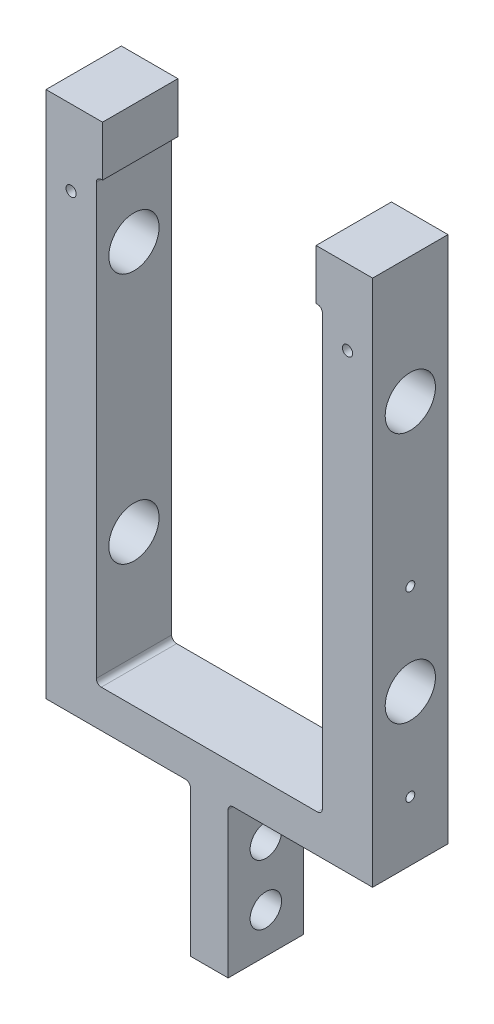
ISO-10303-21;
HEADER;
FILE_DESCRIPTION(('STEP AP214'),'2;1');
FILE_NAME('part.step','',(''),(''),'','','');
FILE_SCHEMA(('AUTOMOTIVE_DESIGN { 1 0 10303 214 1 1 1 1 }'));
ENDSEC;
DATA;
#1=APPLICATION_CONTEXT('core data for automotive mechanical design processes');
#2=APPLICATION_PROTOCOL_DEFINITION('international standard','automotive_design',2000,#1);
#3=PRODUCT_CONTEXT('',#1,'mechanical');
#4=PRODUCT('Part','Part','',(#3));
#5=PRODUCT_RELATED_PRODUCT_CATEGORY('part','',(#4));
#6=PRODUCT_DEFINITION_FORMATION('','',#4);
#7=PRODUCT_DEFINITION_CONTEXT('part definition',#1,'design');
#8=PRODUCT_DEFINITION('design','',#6,#7);
#9=PRODUCT_DEFINITION_SHAPE('','',#8);
#10=(LENGTH_UNIT() NAMED_UNIT(*) SI_UNIT(.MILLI.,.METRE.));
#11=(NAMED_UNIT(*) PLANE_ANGLE_UNIT() SI_UNIT($,.RADIAN.));
#12=(NAMED_UNIT(*) SI_UNIT($,.STERADIAN.) SOLID_ANGLE_UNIT());
#13=UNCERTAINTY_MEASURE_WITH_UNIT(LENGTH_MEASURE(1.E-05),#10,'distance_accuracy_value','');
#14=(GEOMETRIC_REPRESENTATION_CONTEXT(3) GLOBAL_UNCERTAINTY_ASSIGNED_CONTEXT((#13)) GLOBAL_UNIT_ASSIGNED_CONTEXT((#10,
#11,#12)) REPRESENTATION_CONTEXT('',''));
#15=CARTESIAN_POINT('',(0.,0.,0.));
#16=DIRECTION('',(0.,0.,1.));
#17=DIRECTION('',(1.,0.,0.));
#18=AXIS2_PLACEMENT_3D('',#15,#16,#17);
#19=CARTESIAN_POINT('',(41.275,152.4,9.52500000000001));
#20=DIRECTION('',(0.,-1.,0.));
#21=DIRECTION('',(0.,0.,-1.));
#22=AXIS2_PLACEMENT_3D('',#19,#20,#21);
#23=PLANE('',#22);
#24=DIRECTION('',(-1.,0.,0.));
#25=VECTOR('',#24,1.);
#26=CARTESIAN_POINT('',(41.275,152.4,-9.52500000000001));
#27=LINE('',#26,#25);
#28=CARTESIAN_POINT('',(41.275,152.4,-9.52500000000001));
#29=VERTEX_POINT('',#28);
#30=CARTESIAN_POINT('',(26.9875,152.4,-9.52500000000001));
#31=VERTEX_POINT('',#30);
#32=EDGE_CURVE('E275',#29,#31,#27,.T.);
#33=ORIENTED_EDGE('',*,*,#32,.T.);
#34=DIRECTION('',(0.,0.,1.));
#35=VECTOR('',#34,1.);
#36=CARTESIAN_POINT('',(26.9875,152.4,-9.52500000000001));
#37=LINE('',#36,#35);
#38=CARTESIAN_POINT('',(26.9875,152.4,9.52500000000001));
#39=VERTEX_POINT('',#38);
#40=EDGE_CURVE('E258',#31,#39,#37,.T.);
#41=ORIENTED_EDGE('',*,*,#40,.T.);
#42=DIRECTION('',(-1.,0.,0.));
#43=VECTOR('',#42,1.);
#44=CARTESIAN_POINT('',(41.275,152.4,9.52500000000001));
#45=LINE('',#44,#43);
#46=CARTESIAN_POINT('',(41.275,152.4,9.52500000000001));
#47=VERTEX_POINT('',#46);
#48=EDGE_CURVE('E467',#47,#39,#45,.T.);
#49=ORIENTED_EDGE('',*,*,#48,.F.);
#50=DIRECTION('',(0.,0.,-1.));
#51=VECTOR('',#50,1.);
#52=CARTESIAN_POINT('',(41.275,152.4,9.52500000000001));
#53=LINE('',#52,#51);
#54=EDGE_CURVE('E282',#47,#29,#53,.T.);
#55=ORIENTED_EDGE('',*,*,#54,.T.);
#56=EDGE_LOOP('',(#33,#41,#49,#55));
#57=FACE_BOUND('',#56,.T.);
#58=ADVANCED_FACE('F98',(#57),#23,.F.);
#59=CARTESIAN_POINT('',(28.575,139.7,9.52500000000001));
#60=DIRECTION('',(0.,-1.,0.));
#61=DIRECTION('',(0.,0.,-1.));
#62=AXIS2_PLACEMENT_3D('',#59,#60,#61);
#63=PLANE('',#62);
#64=DIRECTION('',(0.,0.,1.));
#65=VECTOR('',#64,1.);
#66=CARTESIAN_POINT('',(26.9875,139.7,-9.52500000000001));
#67=LINE('',#66,#65);
#68=CARTESIAN_POINT('',(26.9875,139.7,-9.52500000000001));
#69=VERTEX_POINT('',#68);
#70=CARTESIAN_POINT('',(26.9875,139.7,9.52500000000001));
#71=VERTEX_POINT('',#70);
#72=EDGE_CURVE('E515',#69,#71,#67,.T.);
#73=ORIENTED_EDGE('',*,*,#72,.F.);
#74=DIRECTION('',(-1.,0.,0.));
#75=VECTOR('',#74,1.);
#76=CARTESIAN_POINT('',(28.575,139.7,-9.52500000000001));
#77=LINE('',#76,#75);
#78=CARTESIAN_POINT('',(27.305,139.7,-9.52500000000001));
#79=VERTEX_POINT('',#78);
#80=EDGE_CURVE('E277',#79,#69,#77,.T.);
#81=ORIENTED_EDGE('',*,*,#80,.F.);
#82=DIRECTION('',(0.,0.,-1.));
#83=VECTOR('',#82,1.);
#84=CARTESIAN_POINT('',(27.305,139.7,9.52500000000001));
#85=LINE('',#84,#83);
#86=CARTESIAN_POINT('',(27.305,139.7,9.52500000000001));
#87=VERTEX_POINT('',#86);
#88=EDGE_CURVE('E374',#79,#87,#85,.F.);
#89=ORIENTED_EDGE('',*,*,#88,.T.);
#90=DIRECTION('',(-1.,0.,0.));
#91=VECTOR('',#90,1.);
#92=CARTESIAN_POINT('',(28.575,139.7,9.52500000000001));
#93=LINE('',#92,#91);
#94=EDGE_CURVE('E436',#87,#71,#93,.T.);
#95=ORIENTED_EDGE('',*,*,#94,.T.);
#96=EDGE_LOOP('',(#73,#81,#89,#95));
#97=FACE_BOUND('',#96,.T.);
#98=ADVANCED_FACE('F514',(#97),#63,.T.);
#99=CARTESIAN_POINT('',(41.275,131.596658993696,9.52500000000001));
#100=DIRECTION('',(-1.,0.,0.));
#101=DIRECTION('',(0.,-1.,0.));
#102=AXIS2_PLACEMENT_3D('',#99,#100,#101);
#103=PLANE('',#102);
#104=CARTESIAN_POINT('',(41.275,80.1624,0.));
#105=DIRECTION('',(1.,0.,0.));
#106=DIRECTION('',(0.,0.,-1.));
#107=AXIS2_PLACEMENT_3D('',#104,#105,#106);
#108=CIRCLE('',#107,1.13029999999999);
#109=CARTESIAN_POINT('',(41.275,80.1624,-1.1303));
#110=VERTEX_POINT('',#109);
#111=EDGE_CURVE('E702',#110,#110,#108,.T.);
#112=ORIENTED_EDGE('',*,*,#111,.F.);
#113=EDGE_LOOP('',(#112));
#114=FACE_BOUND('',#113,.T.);
#115=CARTESIAN_POINT('',(41.275,57.15,0.));
#116=DIRECTION('',(-1.,0.,0.));
#117=DIRECTION('',(0.,-1.,0.));
#118=AXIS2_PLACEMENT_3D('',#115,#116,#117);
#119=CIRCLE('',#118,6.34999999999673);
#120=CARTESIAN_POINT('',(41.275,50.8000000000033,0.));
#121=VERTEX_POINT('',#120);
#122=EDGE_CURVE('E324',#121,#121,#119,.T.);
#123=ORIENTED_EDGE('',*,*,#122,.T.);
#124=EDGE_LOOP('',(#123));
#125=FACE_BOUND('',#124,.T.);
#126=CARTESIAN_POINT('',(41.275,120.65,0.));
#127=DIRECTION('',(-1.,0.,0.));
#128=DIRECTION('',(0.,-1.,0.));
#129=AXIS2_PLACEMENT_3D('',#126,#127,#128);
#130=CIRCLE('',#129,6.34999999999999);
#131=CARTESIAN_POINT('',(41.275,114.3,0.));
#132=VERTEX_POINT('',#131);
#133=EDGE_CURVE('E628',#132,#132,#130,.T.);
#134=ORIENTED_EDGE('',*,*,#133,.T.);
#135=EDGE_LOOP('',(#134));
#136=FACE_BOUND('',#135,.T.);
#137=DIRECTION('',(0.,1.,0.));
#138=VECTOR('',#137,1.);
#139=CARTESIAN_POINT('',(41.275,131.596658993696,-9.52500000000001));
#140=LINE('',#139,#138);
#141=CARTESIAN_POINT('',(41.275,19.05,-9.52500000000001));
#142=VERTEX_POINT('',#141);
#143=EDGE_CURVE('E292',#142,#29,#140,.T.);
#144=ORIENTED_EDGE('',*,*,#143,.T.);
#145=ORIENTED_EDGE('',*,*,#54,.F.);
#146=DIRECTION('',(0.,1.,0.));
#147=VECTOR('',#146,1.);
#148=CARTESIAN_POINT('',(41.275,19.05,9.52500000000001));
#149=LINE('',#148,#147);
#150=CARTESIAN_POINT('',(41.275,19.05,9.52500000000001));
#151=VERTEX_POINT('',#150);
#152=EDGE_CURVE('E463',#151,#47,#149,.T.);
#153=ORIENTED_EDGE('',*,*,#152,.F.);
#154=DIRECTION('',(0.,0.,-1.));
#155=VECTOR('',#154,1.);
#156=CARTESIAN_POINT('',(41.275,19.05,9.52500000000001));
#157=LINE('',#156,#155);
#158=EDGE_CURVE('E314',#151,#142,#157,.T.);
#159=ORIENTED_EDGE('',*,*,#158,.T.);
#160=EDGE_LOOP('',(#144,#145,#153,#159));
#161=FACE_BOUND('',#160,.T.);
#162=CARTESIAN_POINT('',(41.275,34.1376,0.));
#163=DIRECTION('',(1.,0.,0.));
#164=DIRECTION('',(0.,0.,-1.));
#165=AXIS2_PLACEMENT_3D('',#162,#163,#164);
#166=CIRCLE('',#165,1.13029999999999);
#167=CARTESIAN_POINT('',(41.275,34.1376,-1.13029999999999));
#168=VERTEX_POINT('',#167);
#169=EDGE_CURVE('E690',#168,#168,#166,.T.);
#170=ORIENTED_EDGE('',*,*,#169,.F.);
#171=EDGE_LOOP('',(#170));
#172=FACE_BOUND('',#171,.T.);
#173=ADVANCED_FACE('F483',(#114,#125,#136,#161,#172),#103,.F.);
#174=CARTESIAN_POINT('',(28.575,139.7,9.52500000000001));
#175=DIRECTION('',(-1.,0.,0.));
#176=DIRECTION('',(0.,-1.,0.));
#177=AXIS2_PLACEMENT_3D('',#174,#175,#176);
#178=PLANE('',#177);
#179=CARTESIAN_POINT('',(28.575,80.1624,0.));
#180=DIRECTION('',(-1.,0.,0.));
#181=DIRECTION('',(0.,-1.,0.));
#182=AXIS2_PLACEMENT_3D('',#179,#180,#181);
#183=CIRCLE('',#182,1.13029999999999);
#184=CARTESIAN_POINT('',(28.575,79.0321,0.));
#185=VERTEX_POINT('',#184);
#186=EDGE_CURVE('E696',#185,#185,#183,.F.);
#187=ORIENTED_EDGE('',*,*,#186,.T.);
#188=EDGE_LOOP('',(#187));
#189=FACE_BOUND('',#188,.T.);
#190=DIRECTION('',(0.,1.,0.));
#191=VECTOR('',#190,1.);
#192=CARTESIAN_POINT('',(28.575,139.7,-9.52500000000001));
#193=LINE('',#192,#191);
#194=CARTESIAN_POINT('',(28.575,29.845,-9.52500000000001));
#195=VERTEX_POINT('',#194);
#196=CARTESIAN_POINT('',(28.575,138.43,-9.52500000000001));
#197=VERTEX_POINT('',#196);
#198=EDGE_CURVE('E457',#195,#197,#193,.T.);
#199=ORIENTED_EDGE('',*,*,#198,.F.);
#200=DIRECTION('',(0.,0.,-1.));
#201=VECTOR('',#200,1.);
#202=CARTESIAN_POINT('',(28.575,29.845,9.52500000000001));
#203=LINE('',#202,#201);
#204=CARTESIAN_POINT('',(28.575,29.845,9.52500000000001));
#205=VERTEX_POINT('',#204);
#206=EDGE_CURVE('E367',#195,#205,#203,.F.);
#207=ORIENTED_EDGE('',*,*,#206,.T.);
#208=DIRECTION('',(0.,1.,0.));
#209=VECTOR('',#208,1.);
#210=CARTESIAN_POINT('',(28.575,139.7,9.52500000000001));
#211=LINE('',#210,#209);
#212=CARTESIAN_POINT('',(28.575,138.43,9.52500000000001));
#213=VERTEX_POINT('',#212);
#214=EDGE_CURVE('E442',#205,#213,#211,.T.);
#215=ORIENTED_EDGE('',*,*,#214,.T.);
#216=DIRECTION('',(0.,0.,-1.));
#217=VECTOR('',#216,1.);
#218=CARTESIAN_POINT('',(28.575,138.43,-9.52500000000001));
#219=LINE('',#218,#217);
#220=EDGE_CURVE('E363',#213,#197,#219,.T.);
#221=ORIENTED_EDGE('',*,*,#220,.T.);
#222=EDGE_LOOP('',(#199,#207,#215,#221));
#223=FACE_BOUND('',#222,.T.);
#224=CARTESIAN_POINT('',(28.575,120.65,0.));
#225=DIRECTION('',(-1.,0.,0.));
#226=DIRECTION('',(0.,-1.,0.));
#227=AXIS2_PLACEMENT_3D('',#224,#225,#226);
#228=CIRCLE('',#227,6.34999999999999);
#229=CARTESIAN_POINT('',(28.575,114.3,0.));
#230=VERTEX_POINT('',#229);
#231=EDGE_CURVE('E319',#230,#230,#228,.T.);
#232=ORIENTED_EDGE('',*,*,#231,.F.);
#233=EDGE_LOOP('',(#232));
#234=FACE_BOUND('',#233,.T.);
#235=CARTESIAN_POINT('',(28.575,57.15,0.));
#236=DIRECTION('',(-1.,0.,0.));
#237=DIRECTION('',(0.,-1.,0.));
#238=AXIS2_PLACEMENT_3D('',#235,#236,#237);
#239=CIRCLE('',#238,6.34999999999673);
#240=CARTESIAN_POINT('',(28.575,50.8000000000033,0.));
#241=VERTEX_POINT('',#240);
#242=EDGE_CURVE('E325',#241,#241,#239,.T.);
#243=ORIENTED_EDGE('',*,*,#242,.F.);
#244=EDGE_LOOP('',(#243));
#245=FACE_BOUND('',#244,.T.);
#246=CARTESIAN_POINT('',(28.575,34.1376,0.));
#247=DIRECTION('',(-1.,0.,0.));
#248=DIRECTION('',(0.,-1.,0.));
#249=AXIS2_PLACEMENT_3D('',#246,#247,#248);
#250=CIRCLE('',#249,1.13029999999999);
#251=CARTESIAN_POINT('',(28.575,33.0073,0.));
#252=VERTEX_POINT('',#251);
#253=EDGE_CURVE('E501',#252,#252,#250,.F.);
#254=ORIENTED_EDGE('',*,*,#253,.T.);
#255=EDGE_LOOP('',(#254));
#256=FACE_BOUND('',#255,.T.);
#257=ADVANCED_FACE('F524',(#189,#223,#234,#245,#256),#178,.T.);
#258=CARTESIAN_POINT('',(0.,0.,9.52500000000001));
#259=DIRECTION('',(0.,0.,1.));
#260=DIRECTION('',(1.,0.,0.));
#261=AXIS2_PLACEMENT_3D('',#258,#259,#260);
#262=PLANE('',#261);
#263=CARTESIAN_POINT('',(-34.925,133.35,9.52500000000001));
#264=DIRECTION('',(0.,0.,1.));
#265=DIRECTION('',(1.,0.,0.));
#266=AXIS2_PLACEMENT_3D('',#263,#264,#265);
#267=CIRCLE('',#266,1.28904999999999);
#268=CARTESIAN_POINT('',(-33.63595,133.35,9.52500000000001));
#269=VERTEX_POINT('',#268);
#270=EDGE_CURVE('E823',#269,#269,#267,.T.);
#271=ORIENTED_EDGE('',*,*,#270,.F.);
#272=EDGE_LOOP('',(#271));
#273=FACE_BOUND('',#272,.T.);
#274=CARTESIAN_POINT('',(34.925,133.35,9.52500000000001));
#275=DIRECTION('',(0.,0.,1.));
#276=DIRECTION('',(1.,0.,0.));
#277=AXIS2_PLACEMENT_3D('',#274,#275,#276);
#278=CIRCLE('',#277,1.28904999999999);
#279=CARTESIAN_POINT('',(36.21405,133.35,9.52500000000001));
#280=VERTEX_POINT('',#279);
#281=EDGE_CURVE('E815',#280,#280,#278,.T.);
#282=ORIENTED_EDGE('',*,*,#281,.F.);
#283=EDGE_LOOP('',(#282));
#284=FACE_BOUND('',#283,.T.);
#285=DIRECTION('',(0.,1.,0.));
#286=VECTOR('',#285,1.);
#287=CARTESIAN_POINT('',(26.9875,152.4,9.52500000000001));
#288=LINE('',#287,#286);
#289=EDGE_CURVE('E261',#71,#39,#288,.T.);
#290=ORIENTED_EDGE('',*,*,#289,.F.);
#291=ORIENTED_EDGE('',*,*,#94,.F.);
#292=CARTESIAN_POINT('',(27.305,138.43,9.52500000000001));
#293=DIRECTION('',(0.,0.,1.));
#294=DIRECTION('',(1.,0.,0.));
#295=AXIS2_PLACEMENT_3D('',#292,#293,#294);
#296=CIRCLE('',#295,1.27);
#297=EDGE_CURVE('E404',#87,#213,#296,.F.);
#298=ORIENTED_EDGE('',*,*,#297,.T.);
#299=ORIENTED_EDGE('',*,*,#214,.F.);
#300=CARTESIAN_POINT('',(27.305,29.845,9.52500000000001));
#301=DIRECTION('',(0.,0.,1.));
#302=DIRECTION('',(1.,0.,0.));
#303=AXIS2_PLACEMENT_3D('',#300,#301,#302);
#304=CIRCLE('',#303,1.27);
#305=CARTESIAN_POINT('',(27.305,28.575,9.52500000000001));
#306=VERTEX_POINT('',#305);
#307=EDGE_CURVE('E398',#205,#306,#304,.F.);
#308=ORIENTED_EDGE('',*,*,#307,.T.);
#309=DIRECTION('',(1.,0.,0.));
#310=VECTOR('',#309,1.);
#311=CARTESIAN_POINT('',(-28.575,28.575,9.52500000000001));
#312=LINE('',#311,#310);
#313=CARTESIAN_POINT('',(-27.305,28.575,9.52500000000001));
#314=VERTEX_POINT('',#313);
#315=EDGE_CURVE('E435',#314,#306,#312,.T.);
#316=ORIENTED_EDGE('',*,*,#315,.F.);
#317=CARTESIAN_POINT('',(-27.305,29.845,9.52500000000001));
#318=DIRECTION('',(0.,0.,1.));
#319=DIRECTION('',(1.,0.,0.));
#320=AXIS2_PLACEMENT_3D('',#317,#318,#319);
#321=CIRCLE('',#320,1.27);
#322=CARTESIAN_POINT('',(-28.575,29.845,9.52500000000001));
#323=VERTEX_POINT('',#322);
#324=EDGE_CURVE('E392',#314,#323,#321,.F.);
#325=ORIENTED_EDGE('',*,*,#324,.T.);
#326=DIRECTION('',(0.,-1.,0.));
#327=VECTOR('',#326,1.);
#328=CARTESIAN_POINT('',(-28.575,139.7,9.52500000000001));
#329=LINE('',#328,#327);
#330=CARTESIAN_POINT('',(-28.575,138.43,9.52500000000001));
#331=VERTEX_POINT('',#330);
#332=EDGE_CURVE('E431',#331,#323,#329,.T.);
#333=ORIENTED_EDGE('',*,*,#332,.F.);
#334=CARTESIAN_POINT('',(-27.305,138.43,9.52500000000001));
#335=DIRECTION('',(0.,0.,1.));
#336=DIRECTION('',(1.,0.,0.));
#337=AXIS2_PLACEMENT_3D('',#334,#335,#336);
#338=CIRCLE('',#337,1.27);
#339=CARTESIAN_POINT('',(-27.305,139.7,9.52500000000001));
#340=VERTEX_POINT('',#339);
#341=EDGE_CURVE('E12',#331,#340,#338,.F.);
#342=ORIENTED_EDGE('',*,*,#341,.T.);
#343=CARTESIAN_POINT('',(-26.9875,139.7,9.52500000000001));
#344=VERTEX_POINT('',#343);
#345=EDGE_CURVE('E430',#344,#340,#93,.T.);
#346=ORIENTED_EDGE('',*,*,#345,.F.);
#347=DIRECTION('',(0.,-1.,0.));
#348=VECTOR('',#347,1.);
#349=CARTESIAN_POINT('',(-26.9875,152.4,9.52500000000001));
#350=LINE('',#349,#348);
#351=CARTESIAN_POINT('',(-26.9875,152.4,9.52500000000001));
#352=VERTEX_POINT('',#351);
#353=EDGE_CURVE('E114',#352,#344,#350,.T.);
#354=ORIENTED_EDGE('',*,*,#353,.F.);
#355=CARTESIAN_POINT('',(-41.275,152.4,9.52500000000001));
#356=VERTEX_POINT('',#355);
#357=EDGE_CURVE('E466',#352,#356,#45,.T.);
#358=ORIENTED_EDGE('',*,*,#357,.T.);
#359=DIRECTION('',(0.,-1.,0.));
#360=VECTOR('',#359,1.);
#361=CARTESIAN_POINT('',(-41.275,152.4,9.52500000000001));
#362=LINE('',#361,#360);
#363=CARTESIAN_POINT('',(-41.275,19.05,9.52500000000001));
#364=VERTEX_POINT('',#363);
#365=EDGE_CURVE('E470',#356,#364,#362,.T.);
#366=ORIENTED_EDGE('',*,*,#365,.T.);
#367=DIRECTION('',(1.,0.,0.));
#368=VECTOR('',#367,1.);
#369=CARTESIAN_POINT('',(-9.525,19.05,9.52500000000001));
#370=LINE('',#369,#368);
#371=CARTESIAN_POINT('',(-9.525,19.05,9.52500000000001));
#372=VERTEX_POINT('',#371);
#373=EDGE_CURVE('E304',#364,#372,#370,.T.);
#374=ORIENTED_EDGE('',*,*,#373,.T.);
#375=DIRECTION('',(0.,1.,0.));
#376=VECTOR('',#375,1.);
#377=CARTESIAN_POINT('',(-9.525,19.0579297952041,9.52500000000001));
#378=LINE('',#377,#376);
#379=CARTESIAN_POINT('',(-9.525,19.0579297952041,9.52500000000001));
#380=VERTEX_POINT('',#379);
#381=EDGE_CURVE('E657',#372,#380,#378,.T.);
#382=ORIENTED_EDGE('',*,*,#381,.T.);
#383=DIRECTION('',(1.,0.,0.));
#384=VECTOR('',#383,1.);
#385=CARTESIAN_POINT('',(-4.7625,19.0579297952041,9.52500000000001));
#386=LINE('',#385,#384);
#387=CARTESIAN_POINT('',(-6.0325,19.0579297952041,9.52500000000001));
#388=VERTEX_POINT('',#387);
#389=EDGE_CURVE('E651',#380,#388,#386,.T.);
#390=ORIENTED_EDGE('',*,*,#389,.T.);
#391=CARTESIAN_POINT('',(-6.0325,17.7879297952041,9.52500000000001));
#392=DIRECTION('',(0.,0.,1.));
#393=DIRECTION('',(1.,0.,0.));
#394=AXIS2_PLACEMENT_3D('',#391,#392,#393);
#395=CIRCLE('',#394,1.27);
#396=CARTESIAN_POINT('',(-4.7625,17.7879297952041,9.52500000000001));
#397=VERTEX_POINT('',#396);
#398=EDGE_CURVE('E386',#388,#397,#395,.F.);
#399=ORIENTED_EDGE('',*,*,#398,.T.);
#400=DIRECTION('',(0.,-1.,0.));
#401=VECTOR('',#400,1.);
#402=CARTESIAN_POINT('',(-4.7625,19.0579297952041,9.52500000000001));
#403=LINE('',#402,#401);
#404=CARTESIAN_POINT('',(-4.7625,-19.05,9.52500000000001));
#405=VERTEX_POINT('',#404);
#406=EDGE_CURVE('E646',#397,#405,#403,.T.);
#407=ORIENTED_EDGE('',*,*,#406,.T.);
#408=DIRECTION('',(-1.,0.,0.));
#409=VECTOR('',#408,1.);
#410=CARTESIAN_POINT('',(4.7625,-19.05,9.52500000000001));
#411=LINE('',#410,#409);
#412=CARTESIAN_POINT('',(4.7625,-19.05,9.52500000000001));
#413=VERTEX_POINT('',#412);
#414=EDGE_CURVE('E719',#413,#405,#411,.T.);
#415=ORIENTED_EDGE('',*,*,#414,.F.);
#416=DIRECTION('',(0.,1.,0.));
#417=VECTOR('',#416,1.);
#418=CARTESIAN_POINT('',(4.7625,19.05,9.52500000000001));
#419=LINE('',#418,#417);
#420=CARTESIAN_POINT('',(4.7625,17.78,9.52500000000001));
#421=VERTEX_POINT('',#420);
#422=EDGE_CURVE('E500',#413,#421,#419,.T.);
#423=ORIENTED_EDGE('',*,*,#422,.T.);
#424=CARTESIAN_POINT('',(6.0325,17.78,9.52500000000001));
#425=DIRECTION('',(0.,0.,1.));
#426=DIRECTION('',(1.,0.,0.));
#427=AXIS2_PLACEMENT_3D('',#424,#425,#426);
#428=CIRCLE('',#427,1.27);
#429=CARTESIAN_POINT('',(6.0325,19.05,9.52500000000001));
#430=VERTEX_POINT('',#429);
#431=EDGE_CURVE('E380',#421,#430,#428,.F.);
#432=ORIENTED_EDGE('',*,*,#431,.T.);
#433=DIRECTION('',(1.,0.,0.));
#434=VECTOR('',#433,1.);
#435=CARTESIAN_POINT('',(9.525,19.05,9.52500000000001));
#436=LINE('',#435,#434);
#437=EDGE_CURVE('E299',#430,#151,#436,.T.);
#438=ORIENTED_EDGE('',*,*,#437,.T.);
#439=ORIENTED_EDGE('',*,*,#152,.T.);
#440=ORIENTED_EDGE('',*,*,#48,.T.);
#441=EDGE_LOOP('',(#290,#291,#298,#299,#308,#316,#325,#333,#342,#346,#354,#358,#366,#374,#382,
#390,#399,#407,#415,#423,#432,#438,#439,#440));
#442=FACE_BOUND('',#441,.T.);
#443=ADVANCED_FACE('F429',(#273,#284,#442),#262,.T.);
#444=CARTESIAN_POINT('',(0.,0.,-9.52500000000001));
#445=DIRECTION('',(0.,0.,1.));
#446=DIRECTION('',(1.,0.,0.));
#447=AXIS2_PLACEMENT_3D('',#444,#445,#446);
#448=PLANE('',#447);
#449=CARTESIAN_POINT('',(-34.925,133.35,-9.52499999999999));
#450=DIRECTION('',(0.,0.,1.));
#451=DIRECTION('',(1.,0.,0.));
#452=AXIS2_PLACEMENT_3D('',#449,#450,#451);
#453=CIRCLE('',#452,1.28904999999999);
#454=CARTESIAN_POINT('',(-33.63595,133.35,-9.52499999999999));
#455=VERTEX_POINT('',#454);
#456=EDGE_CURVE('E819',#455,#455,#453,.T.);
#457=ORIENTED_EDGE('',*,*,#456,.T.);
#458=EDGE_LOOP('',(#457));
#459=FACE_BOUND('',#458,.T.);
#460=CARTESIAN_POINT('',(34.925,133.35,-9.52499999999999));
#461=DIRECTION('',(0.,0.,1.));
#462=DIRECTION('',(1.,0.,0.));
#463=AXIS2_PLACEMENT_3D('',#460,#461,#462);
#464=CIRCLE('',#463,1.28904999999999);
#465=CARTESIAN_POINT('',(36.21405,133.35,-9.52499999999999));
#466=VERTEX_POINT('',#465);
#467=EDGE_CURVE('E511',#466,#466,#464,.T.);
#468=ORIENTED_EDGE('',*,*,#467,.T.);
#469=EDGE_LOOP('',(#468));
#470=FACE_BOUND('',#469,.T.);
#471=ORIENTED_EDGE('',*,*,#80,.T.);
#472=DIRECTION('',(0.,1.,0.));
#473=VECTOR('',#472,1.);
#474=CARTESIAN_POINT('',(26.9875,152.4,-9.52500000000001));
#475=LINE('',#474,#473);
#476=EDGE_CURVE('E122',#69,#31,#475,.T.);
#477=ORIENTED_EDGE('',*,*,#476,.T.);
#478=ORIENTED_EDGE('',*,*,#32,.F.);
#479=ORIENTED_EDGE('',*,*,#143,.F.);
#480=DIRECTION('',(1.,0.,0.));
#481=VECTOR('',#480,1.);
#482=CARTESIAN_POINT('',(9.525,19.05,-9.52500000000001));
#483=LINE('',#482,#481);
#484=CARTESIAN_POINT('',(6.0325,19.05,-9.52500000000001));
#485=VERTEX_POINT('',#484);
#486=EDGE_CURVE('E451',#485,#142,#483,.T.);
#487=ORIENTED_EDGE('',*,*,#486,.F.);
#488=CARTESIAN_POINT('',(6.0325,17.78,-9.52500000000001));
#489=DIRECTION('',(0.,0.,1.));
#490=DIRECTION('',(1.,0.,0.));
#491=AXIS2_PLACEMENT_3D('',#488,#489,#490);
#492=CIRCLE('',#491,1.27);
#493=CARTESIAN_POINT('',(4.7625,17.78,-9.52500000000001));
#494=VERTEX_POINT('',#493);
#495=EDGE_CURVE('E377',#485,#494,#492,.T.);
#496=ORIENTED_EDGE('',*,*,#495,.T.);
#497=DIRECTION('',(0.,1.,0.));
#498=VECTOR('',#497,1.);
#499=CARTESIAN_POINT('',(4.7625,19.05,-9.52500000000001));
#500=LINE('',#499,#498);
#501=CARTESIAN_POINT('',(4.7625,-19.05,-9.52500000000001));
#502=VERTEX_POINT('',#501);
#503=EDGE_CURVE('E488',#502,#494,#500,.T.);
#504=ORIENTED_EDGE('',*,*,#503,.F.);
#505=DIRECTION('',(1.,0.,0.));
#506=VECTOR('',#505,1.);
#507=CARTESIAN_POINT('',(4.7625,-19.05,-9.52500000000001));
#508=LINE('',#507,#506);
#509=CARTESIAN_POINT('',(-4.7625,-19.05,-9.52500000000001));
#510=VERTEX_POINT('',#509);
#511=EDGE_CURVE('E708',#510,#502,#508,.T.);
#512=ORIENTED_EDGE('',*,*,#511,.F.);
#513=DIRECTION('',(0.,-1.,0.));
#514=VECTOR('',#513,1.);
#515=CARTESIAN_POINT('',(-4.7625,19.0579297952041,-9.52500000000001));
#516=LINE('',#515,#514);
#517=CARTESIAN_POINT('',(-4.7625,17.7879297952041,-9.52500000000001));
#518=VERTEX_POINT('',#517);
#519=EDGE_CURVE('E663',#518,#510,#516,.T.);
#520=ORIENTED_EDGE('',*,*,#519,.F.);
#521=CARTESIAN_POINT('',(-6.0325,17.7879297952041,-9.52500000000001));
#522=DIRECTION('',(0.,0.,1.));
#523=DIRECTION('',(1.,0.,0.));
#524=AXIS2_PLACEMENT_3D('',#521,#522,#523);
#525=CIRCLE('',#524,1.27);
#526=CARTESIAN_POINT('',(-6.0325,19.0579297952041,-9.52500000000001));
#527=VERTEX_POINT('',#526);
#528=EDGE_CURVE('E383',#518,#527,#525,.T.);
#529=ORIENTED_EDGE('',*,*,#528,.T.);
#530=DIRECTION('',(1.,0.,0.));
#531=VECTOR('',#530,1.);
#532=CARTESIAN_POINT('',(-4.7625,19.0579297952041,-9.52500000000001));
#533=LINE('',#532,#531);
#534=CARTESIAN_POINT('',(-9.525,19.0579297952041,-9.52500000000001));
#535=VERTEX_POINT('',#534);
#536=EDGE_CURVE('E668',#535,#527,#533,.T.);
#537=ORIENTED_EDGE('',*,*,#536,.F.);
#538=DIRECTION('',(0.,1.,0.));
#539=VECTOR('',#538,1.);
#540=CARTESIAN_POINT('',(-9.525,19.0579297952041,-9.52500000000001));
#541=LINE('',#540,#539);
#542=CARTESIAN_POINT('',(-9.525,19.05,-9.52500000000001));
#543=VERTEX_POINT('',#542);
#544=EDGE_CURVE('E674',#543,#535,#541,.T.);
#545=ORIENTED_EDGE('',*,*,#544,.F.);
#546=DIRECTION('',(1.,0.,0.));
#547=VECTOR('',#546,1.);
#548=CARTESIAN_POINT('',(-9.525,19.05,-9.52500000000001));
#549=LINE('',#548,#547);
#550=CARTESIAN_POINT('',(-41.275,19.05,-9.52500000000001));
#551=VERTEX_POINT('',#550);
#552=EDGE_CURVE('E290',#551,#543,#549,.T.);
#553=ORIENTED_EDGE('',*,*,#552,.F.);
#554=DIRECTION('',(0.,-1.,0.));
#555=VECTOR('',#554,1.);
#556=CARTESIAN_POINT('',(-41.275,19.05,-9.52500000000001));
#557=LINE('',#556,#555);
#558=CARTESIAN_POINT('',(-41.275,152.4,-9.52500000000001));
#559=VERTEX_POINT('',#558);
#560=EDGE_CURVE('E284',#559,#551,#557,.T.);
#561=ORIENTED_EDGE('',*,*,#560,.F.);
#562=CARTESIAN_POINT('',(-26.9875,152.4,-9.52500000000001));
#563=VERTEX_POINT('',#562);
#564=EDGE_CURVE('E285',#563,#559,#27,.T.);
#565=ORIENTED_EDGE('',*,*,#564,.F.);
#566=DIRECTION('',(0.,-1.,0.));
#567=VECTOR('',#566,1.);
#568=CARTESIAN_POINT('',(-26.9875,152.4,-9.52500000000001));
#569=LINE('',#568,#567);
#570=CARTESIAN_POINT('',(-26.9875,139.7,-9.52500000000001));
#571=VERTEX_POINT('',#570);
#572=EDGE_CURVE('E268',#563,#571,#569,.T.);
#573=ORIENTED_EDGE('',*,*,#572,.T.);
#574=CARTESIAN_POINT('',(-27.305,139.7,-9.52500000000001));
#575=VERTEX_POINT('',#574);
#576=EDGE_CURVE('E414',#571,#575,#77,.T.);
#577=ORIENTED_EDGE('',*,*,#576,.T.);
#578=CARTESIAN_POINT('',(-27.305,138.43,-9.52500000000001));
#579=DIRECTION('',(0.,0.,1.));
#580=DIRECTION('',(1.,0.,0.));
#581=AXIS2_PLACEMENT_3D('',#578,#579,#580);
#582=CIRCLE('',#581,1.27);
#583=CARTESIAN_POINT('',(-28.575,138.43,-9.52500000000001));
#584=VERTEX_POINT('',#583);
#585=EDGE_CURVE('E107',#575,#584,#582,.T.);
#586=ORIENTED_EDGE('',*,*,#585,.T.);
#587=DIRECTION('',(0.,-1.,0.));
#588=VECTOR('',#587,1.);
#589=CARTESIAN_POINT('',(-28.575,139.7,-9.52500000000001));
#590=LINE('',#589,#588);
#591=CARTESIAN_POINT('',(-28.575,29.845,-9.52500000000001));
#592=VERTEX_POINT('',#591);
#593=EDGE_CURVE('E411',#584,#592,#590,.T.);
#594=ORIENTED_EDGE('',*,*,#593,.T.);
#595=CARTESIAN_POINT('',(-27.305,29.845,-9.52500000000001));
#596=DIRECTION('',(0.,0.,1.));
#597=DIRECTION('',(1.,0.,0.));
#598=AXIS2_PLACEMENT_3D('',#595,#596,#597);
#599=CIRCLE('',#598,1.27);
#600=CARTESIAN_POINT('',(-27.305,28.575,-9.52500000000001));
#601=VERTEX_POINT('',#600);
#602=EDGE_CURVE('E389',#592,#601,#599,.T.);
#603=ORIENTED_EDGE('',*,*,#602,.T.);
#604=DIRECTION('',(1.,0.,0.));
#605=VECTOR('',#604,1.);
#606=CARTESIAN_POINT('',(-28.575,28.575,-9.52500000000001));
#607=LINE('',#606,#605);
#608=CARTESIAN_POINT('',(27.305,28.575,-9.52500000000001));
#609=VERTEX_POINT('',#608);
#610=EDGE_CURVE('E424',#601,#609,#607,.T.);
#611=ORIENTED_EDGE('',*,*,#610,.T.);
#612=CARTESIAN_POINT('',(27.305,29.845,-9.52500000000001));
#613=DIRECTION('',(0.,0.,1.));
#614=DIRECTION('',(1.,0.,0.));
#615=AXIS2_PLACEMENT_3D('',#612,#613,#614);
#616=CIRCLE('',#615,1.27);
#617=EDGE_CURVE('E395',#609,#195,#616,.T.);
#618=ORIENTED_EDGE('',*,*,#617,.T.);
#619=ORIENTED_EDGE('',*,*,#198,.T.);
#620=CARTESIAN_POINT('',(27.305,138.43,-9.52500000000001));
#621=DIRECTION('',(0.,0.,1.));
#622=DIRECTION('',(1.,0.,0.));
#623=AXIS2_PLACEMENT_3D('',#620,#621,#622);
#624=CIRCLE('',#623,1.27);
#625=EDGE_CURVE('E401',#197,#79,#624,.T.);
#626=ORIENTED_EDGE('',*,*,#625,.T.);
#627=EDGE_LOOP('',(#471,#477,#478,#479,#487,#496,#504,#512,#520,#529,#537,#545,#553,#561,#565,
#573,#577,#586,#594,#603,#611,#618,#619,#626));
#628=FACE_BOUND('',#627,.T.);
#629=ADVANCED_FACE('F273',(#459,#470,#628),#448,.F.);
#630=CARTESIAN_POINT('',(9.525,19.05,9.52500000000001));
#631=DIRECTION('',(0.,1.,0.));
#632=DIRECTION('',(-1.,0.,0.));
#633=AXIS2_PLACEMENT_3D('',#630,#631,#632);
#634=PLANE('',#633);
#635=ORIENTED_EDGE('',*,*,#437,.F.);
#636=DIRECTION('',(0.,0.,-1.));
#637=VECTOR('',#636,1.);
#638=CARTESIAN_POINT('',(6.0325,19.05,-9.52500000000001));
#639=LINE('',#638,#637);
#640=EDGE_CURVE('E318',#430,#485,#639,.T.);
#641=ORIENTED_EDGE('',*,*,#640,.T.);
#642=ORIENTED_EDGE('',*,*,#486,.T.);
#643=ORIENTED_EDGE('',*,*,#158,.F.);
#644=EDGE_LOOP('',(#635,#641,#642,#643));
#645=FACE_BOUND('',#644,.T.);
#646=ADVANCED_FACE('F507',(#645),#634,.F.);
#647=ORIENTED_EDGE('',*,*,#357,.F.);
#648=DIRECTION('',(0.,0.,1.));
#649=VECTOR('',#648,1.);
#650=CARTESIAN_POINT('',(-26.9875,152.4,-9.52500000000001));
#651=LINE('',#650,#649);
#652=EDGE_CURVE('E267',#563,#352,#651,.T.);
#653=ORIENTED_EDGE('',*,*,#652,.F.);
#654=ORIENTED_EDGE('',*,*,#564,.T.);
#655=DIRECTION('',(0.,0.,-1.));
#656=VECTOR('',#655,1.);
#657=CARTESIAN_POINT('',(-41.275,152.4,9.52500000000001));
#658=LINE('',#657,#656);
#659=EDGE_CURVE('E308',#356,#559,#658,.T.);
#660=ORIENTED_EDGE('',*,*,#659,.F.);
#661=EDGE_LOOP('',(#647,#653,#654,#660));
#662=FACE_BOUND('',#661,.T.);
#663=ADVANCED_FACE('F548',(#662),#23,.F.);
#664=CARTESIAN_POINT('',(-41.275,19.05,9.52500000000001));
#665=DIRECTION('',(1.,0.,0.));
#666=DIRECTION('',(0.,1.,0.));
#667=AXIS2_PLACEMENT_3D('',#664,#665,#666);
#668=PLANE('',#667);
#669=CARTESIAN_POINT('',(-41.275,57.15,0.));
#670=DIRECTION('',(-1.,0.,0.));
#671=DIRECTION('',(0.,-1.,0.));
#672=AXIS2_PLACEMENT_3D('',#669,#670,#671);
#673=CIRCLE('',#672,6.34999999999673);
#674=CARTESIAN_POINT('',(-41.275,50.8000000000033,0.));
#675=VERTEX_POINT('',#674);
#676=EDGE_CURVE('E622',#675,#675,#673,.T.);
#677=ORIENTED_EDGE('',*,*,#676,.F.);
#678=EDGE_LOOP('',(#677));
#679=FACE_BOUND('',#678,.T.);
#680=CARTESIAN_POINT('',(-41.275,120.65,0.));
#681=DIRECTION('',(-1.,0.,0.));
#682=DIRECTION('',(0.,-1.,0.));
#683=AXIS2_PLACEMENT_3D('',#680,#681,#682);
#684=CIRCLE('',#683,6.34999999999999);
#685=CARTESIAN_POINT('',(-41.275,114.3,0.));
#686=VERTEX_POINT('',#685);
#687=EDGE_CURVE('E634',#686,#686,#684,.T.);
#688=ORIENTED_EDGE('',*,*,#687,.F.);
#689=EDGE_LOOP('',(#688));
#690=FACE_BOUND('',#689,.T.);
#691=ORIENTED_EDGE('',*,*,#560,.T.);
#692=DIRECTION('',(0.,0.,-1.));
#693=VECTOR('',#692,1.);
#694=CARTESIAN_POINT('',(-41.275,19.05,9.52500000000001));
#695=LINE('',#694,#693);
#696=EDGE_CURVE('E303',#364,#551,#695,.T.);
#697=ORIENTED_EDGE('',*,*,#696,.F.);
#698=ORIENTED_EDGE('',*,*,#365,.F.);
#699=ORIENTED_EDGE('',*,*,#659,.T.);
#700=EDGE_LOOP('',(#691,#697,#698,#699));
#701=FACE_BOUND('',#700,.T.);
#702=ADVANCED_FACE('F557',(#679,#690,#701),#668,.F.);
#703=CARTESIAN_POINT('',(-9.525,19.05,9.52500000000001));
#704=DIRECTION('',(0.,1.,0.));
#705=DIRECTION('',(-1.,0.,0.));
#706=AXIS2_PLACEMENT_3D('',#703,#704,#705);
#707=PLANE('',#706);
#708=ORIENTED_EDGE('',*,*,#552,.T.);
#709=DIRECTION('',(0.,0.,-1.));
#710=VECTOR('',#709,1.);
#711=CARTESIAN_POINT('',(-9.525,19.05,9.52500000000001));
#712=LINE('',#711,#710);
#713=EDGE_CURVE('E300',#372,#543,#712,.T.);
#714=ORIENTED_EDGE('',*,*,#713,.F.);
#715=ORIENTED_EDGE('',*,*,#373,.F.);
#716=ORIENTED_EDGE('',*,*,#696,.T.);
#717=EDGE_LOOP('',(#708,#714,#715,#716));
#718=FACE_BOUND('',#717,.T.);
#719=ADVANCED_FACE('F563',(#718),#707,.F.);
#720=DIRECTION('',(0.,0.,1.));
#721=VECTOR('',#720,1.);
#722=CARTESIAN_POINT('',(-26.9875,139.7,-9.52500000000001));
#723=LINE('',#722,#721);
#724=EDGE_CURVE('E801',#571,#344,#723,.T.);
#725=ORIENTED_EDGE('',*,*,#724,.T.);
#726=ORIENTED_EDGE('',*,*,#345,.T.);
#727=DIRECTION('',(0.,0.,-1.));
#728=VECTOR('',#727,1.);
#729=CARTESIAN_POINT('',(-27.305,139.7,-9.52500000000001));
#730=LINE('',#729,#728);
#731=EDGE_CURVE('E370',#340,#575,#730,.T.);
#732=ORIENTED_EDGE('',*,*,#731,.T.);
#733=ORIENTED_EDGE('',*,*,#576,.F.);
#734=EDGE_LOOP('',(#725,#726,#732,#733));
#735=FACE_BOUND('',#734,.T.);
#736=ADVANCED_FACE('F553',(#735),#63,.T.);
#737=CARTESIAN_POINT('',(-28.575,139.7,9.52500000000001));
#738=DIRECTION('',(1.,0.,0.));
#739=DIRECTION('',(0.,1.,0.));
#740=AXIS2_PLACEMENT_3D('',#737,#738,#739);
#741=PLANE('',#740);
#742=CARTESIAN_POINT('',(-28.575,57.15,0.));
#743=DIRECTION('',(1.,0.,0.));
#744=DIRECTION('',(0.,1.,0.));
#745=AXIS2_PLACEMENT_3D('',#742,#743,#744);
#746=CIRCLE('',#745,6.34999999999673);
#747=CARTESIAN_POINT('',(-28.575,63.4999999999967,0.));
#748=VERTEX_POINT('',#747);
#749=EDGE_CURVE('E329',#748,#748,#746,.T.);
#750=ORIENTED_EDGE('',*,*,#749,.F.);
#751=EDGE_LOOP('',(#750));
#752=FACE_BOUND('',#751,.T.);
#753=CARTESIAN_POINT('',(-28.575,120.65,0.));
#754=DIRECTION('',(1.,0.,0.));
#755=DIRECTION('',(0.,1.,0.));
#756=AXIS2_PLACEMENT_3D('',#753,#754,#755);
#757=CIRCLE('',#756,6.34999999999999);
#758=CARTESIAN_POINT('',(-28.575,127.,0.));
#759=VERTEX_POINT('',#758);
#760=EDGE_CURVE('E323',#759,#759,#757,.T.);
#761=ORIENTED_EDGE('',*,*,#760,.F.);
#762=EDGE_LOOP('',(#761));
#763=FACE_BOUND('',#762,.T.);
#764=ORIENTED_EDGE('',*,*,#332,.T.);
#765=DIRECTION('',(0.,0.,-1.));
#766=VECTOR('',#765,1.);
#767=CARTESIAN_POINT('',(-28.575,29.845,-9.52500000000001));
#768=LINE('',#767,#766);
#769=EDGE_CURVE('E352',#323,#592,#768,.T.);
#770=ORIENTED_EDGE('',*,*,#769,.T.);
#771=ORIENTED_EDGE('',*,*,#593,.F.);
#772=DIRECTION('',(0.,0.,-1.));
#773=VECTOR('',#772,1.);
#774=CARTESIAN_POINT('',(-28.575,138.43,9.52500000000001));
#775=LINE('',#774,#773);
#776=EDGE_CURVE('E349',#584,#331,#775,.F.);
#777=ORIENTED_EDGE('',*,*,#776,.T.);
#778=EDGE_LOOP('',(#764,#770,#771,#777));
#779=FACE_BOUND('',#778,.T.);
#780=ADVANCED_FACE('F420',(#752,#763,#779),#741,.T.);
#781=CARTESIAN_POINT('',(-28.575,28.575,9.52500000000001));
#782=DIRECTION('',(0.,1.,0.));
#783=DIRECTION('',(-1.,0.,0.));
#784=AXIS2_PLACEMENT_3D('',#781,#782,#783);
#785=PLANE('',#784);
#786=ORIENTED_EDGE('',*,*,#610,.F.);
#787=DIRECTION('',(0.,0.,-1.));
#788=VECTOR('',#787,1.);
#789=CARTESIAN_POINT('',(-27.305,28.575,9.52500000000001));
#790=LINE('',#789,#788);
#791=EDGE_CURVE('E360',#601,#314,#790,.F.);
#792=ORIENTED_EDGE('',*,*,#791,.T.);
#793=ORIENTED_EDGE('',*,*,#315,.T.);
#794=DIRECTION('',(0.,0.,-1.));
#795=VECTOR('',#794,1.);
#796=CARTESIAN_POINT('',(27.305,28.575,-9.52500000000001));
#797=LINE('',#796,#795);
#798=EDGE_CURVE('E356',#306,#609,#797,.T.);
#799=ORIENTED_EDGE('',*,*,#798,.T.);
#800=EDGE_LOOP('',(#786,#792,#793,#799));
#801=FACE_BOUND('',#800,.T.);
#802=ADVANCED_FACE('F532',(#801),#785,.T.);
#803=CARTESIAN_POINT('',(41.275,120.65,0.));
#804=DIRECTION('',(-1.,0.,0.));
#805=DIRECTION('',(0.,-1.,0.));
#806=AXIS2_PLACEMENT_3D('',#803,#804,#805);
#807=CYLINDRICAL_SURFACE('',#806,6.34999999999999);
#808=ORIENTED_EDGE('',*,*,#231,.T.);
#809=EDGE_LOOP('',(#808));
#810=FACE_BOUND('',#809,.T.);
#811=ORIENTED_EDGE('',*,*,#133,.F.);
#812=EDGE_LOOP('',(#811));
#813=FACE_BOUND('',#812,.T.);
#814=ADVANCED_FACE('F891',(#810,#813),#807,.F.);
#815=CARTESIAN_POINT('',(41.275,57.15,0.));
#816=DIRECTION('',(-1.,0.,0.));
#817=DIRECTION('',(0.,-1.,0.));
#818=AXIS2_PLACEMENT_3D('',#815,#816,#817);
#819=CYLINDRICAL_SURFACE('',#818,6.34999999999673);
#820=ORIENTED_EDGE('',*,*,#242,.T.);
#821=EDGE_LOOP('',(#820));
#822=FACE_BOUND('',#821,.T.);
#823=ORIENTED_EDGE('',*,*,#122,.F.);
#824=EDGE_LOOP('',(#823));
#825=FACE_BOUND('',#824,.T.);
#826=ADVANCED_FACE('F887',(#822,#825),#819,.F.);
#827=ORIENTED_EDGE('',*,*,#760,.T.);
#828=EDGE_LOOP('',(#827));
#829=FACE_BOUND('',#828,.T.);
#830=ORIENTED_EDGE('',*,*,#687,.T.);
#831=EDGE_LOOP('',(#830));
#832=FACE_BOUND('',#831,.T.);
#833=ADVANCED_FACE('F890',(#829,#832),#807,.F.);
#834=ORIENTED_EDGE('',*,*,#749,.T.);
#835=EDGE_LOOP('',(#834));
#836=FACE_BOUND('',#835,.T.);
#837=ORIENTED_EDGE('',*,*,#676,.T.);
#838=EDGE_LOOP('',(#837));
#839=FACE_BOUND('',#838,.T.);
#840=ADVANCED_FACE('F882',(#836,#839),#819,.F.);
#841=CARTESIAN_POINT('',(-9.525,19.0579297952041,9.52500000000001));
#842=DIRECTION('',(-1.,0.,0.));
#843=DIRECTION('',(0.,0.,1.));
#844=AXIS2_PLACEMENT_3D('',#841,#842,#843);
#845=PLANE('',#844);
#846=ORIENTED_EDGE('',*,*,#544,.T.);
#847=DIRECTION('',(0.,0.,-1.));
#848=VECTOR('',#847,1.);
#849=CARTESIAN_POINT('',(-9.525,19.0579297952041,9.52500000000001));
#850=LINE('',#849,#848);
#851=EDGE_CURVE('E640',#380,#535,#850,.T.);
#852=ORIENTED_EDGE('',*,*,#851,.F.);
#853=ORIENTED_EDGE('',*,*,#381,.F.);
#854=ORIENTED_EDGE('',*,*,#713,.T.);
#855=EDGE_LOOP('',(#846,#852,#853,#854));
#856=FACE_BOUND('',#855,.T.);
#857=ADVANCED_FACE('F875',(#856),#845,.F.);
#858=CARTESIAN_POINT('',(-4.7625,19.0579297952041,9.52500000000001));
#859=DIRECTION('',(1.,0.,0.));
#860=DIRECTION('',(0.,1.,0.));
#861=AXIS2_PLACEMENT_3D('',#858,#859,#860);
#862=PLANE('',#861);
#863=CARTESIAN_POINT('',(-4.7625,6.35,0.));
#864=DIRECTION('',(-1.,0.,0.));
#865=DIRECTION('',(0.,0.,1.));
#866=AXIS2_PLACEMENT_3D('',#863,#864,#865);
#867=CIRCLE('',#866,3.97256);
#868=CARTESIAN_POINT('',(-4.7625,6.35,3.97256));
#869=VERTEX_POINT('',#868);
#870=EDGE_CURVE('E335',#869,#869,#867,.T.);
#871=ORIENTED_EDGE('',*,*,#870,.F.);
#872=EDGE_LOOP('',(#871));
#873=FACE_BOUND('',#872,.T.);
#874=CARTESIAN_POINT('',(-4.7625,-8.89,0.));
#875=DIRECTION('',(-1.,0.,0.));
#876=DIRECTION('',(0.,0.,1.));
#877=AXIS2_PLACEMENT_3D('',#874,#875,#876);
#878=CIRCLE('',#877,3.97256);
#879=CARTESIAN_POINT('',(-4.7625,-8.89,3.97256));
#880=VERTEX_POINT('',#879);
#881=EDGE_CURVE('E334',#880,#880,#878,.T.);
#882=ORIENTED_EDGE('',*,*,#881,.F.);
#883=EDGE_LOOP('',(#882));
#884=FACE_BOUND('',#883,.T.);
#885=ORIENTED_EDGE('',*,*,#406,.F.);
#886=DIRECTION('',(0.,0.,-1.));
#887=VECTOR('',#886,1.);
#888=CARTESIAN_POINT('',(-4.7625,17.7879297952041,-9.52500000000001));
#889=LINE('',#888,#887);
#890=EDGE_CURVE('E342',#397,#518,#889,.T.);
#891=ORIENTED_EDGE('',*,*,#890,.T.);
#892=ORIENTED_EDGE('',*,*,#519,.T.);
#893=DIRECTION('',(0.,0.,-1.));
#894=VECTOR('',#893,1.);
#895=CARTESIAN_POINT('',(-4.7625,-19.05,-9.52500000000001));
#896=LINE('',#895,#894);
#897=EDGE_CURVE('E713',#405,#510,#896,.T.);
#898=ORIENTED_EDGE('',*,*,#897,.F.);
#899=EDGE_LOOP('',(#885,#891,#892,#898));
#900=FACE_BOUND('',#899,.T.);
#901=ADVANCED_FACE('F871',(#873,#884,#900),#862,.F.);
#902=CARTESIAN_POINT('',(-4.7625,19.0579297952041,9.52500000000001));
#903=DIRECTION('',(0.,1.,0.));
#904=DIRECTION('',(-1.,0.,0.));
#905=AXIS2_PLACEMENT_3D('',#902,#903,#904);
#906=PLANE('',#905);
#907=ORIENTED_EDGE('',*,*,#536,.T.);
#908=DIRECTION('',(0.,0.,-1.));
#909=VECTOR('',#908,1.);
#910=CARTESIAN_POINT('',(-6.0325,19.0579297952041,9.52500000000001));
#911=LINE('',#910,#909);
#912=EDGE_CURVE('E346',#527,#388,#911,.F.);
#913=ORIENTED_EDGE('',*,*,#912,.T.);
#914=ORIENTED_EDGE('',*,*,#389,.F.);
#915=ORIENTED_EDGE('',*,*,#851,.T.);
#916=EDGE_LOOP('',(#907,#913,#914,#915));
#917=FACE_BOUND('',#916,.T.);
#918=ADVANCED_FACE('F874',(#917),#906,.F.);
#919=CARTESIAN_POINT('',(4.7625,19.05,9.52500000000001));
#920=DIRECTION('',(-1.,0.,0.));
#921=DIRECTION('',(0.,-1.,0.));
#922=AXIS2_PLACEMENT_3D('',#919,#920,#921);
#923=PLANE('',#922);
#924=CARTESIAN_POINT('',(4.7625,6.35,0.));
#925=DIRECTION('',(-1.,0.,0.));
#926=DIRECTION('',(0.,-1.,0.));
#927=AXIS2_PLACEMENT_3D('',#924,#925,#926);
#928=CIRCLE('',#927,3.97256);
#929=CARTESIAN_POINT('',(4.7625,2.37744,0.));
#930=VERTEX_POINT('',#929);
#931=EDGE_CURVE('E330',#930,#930,#928,.T.);
#932=ORIENTED_EDGE('',*,*,#931,.T.);
#933=EDGE_LOOP('',(#932));
#934=FACE_BOUND('',#933,.T.);
#935=CARTESIAN_POINT('',(4.7625,-8.89,0.));
#936=DIRECTION('',(-1.,0.,0.));
#937=DIRECTION('',(0.,-1.,0.));
#938=AXIS2_PLACEMENT_3D('',#935,#936,#937);
#939=CIRCLE('',#938,3.97256);
#940=CARTESIAN_POINT('',(4.7625,-12.86256,0.));
#941=VERTEX_POINT('',#940);
#942=EDGE_CURVE('E729',#941,#941,#939,.T.);
#943=ORIENTED_EDGE('',*,*,#942,.T.);
#944=EDGE_LOOP('',(#943));
#945=FACE_BOUND('',#944,.T.);
#946=ORIENTED_EDGE('',*,*,#503,.T.);
#947=DIRECTION('',(0.,0.,-1.));
#948=VECTOR('',#947,1.);
#949=CARTESIAN_POINT('',(4.7625,17.78,9.52500000000001));
#950=LINE('',#949,#948);
#951=EDGE_CURVE('E339',#494,#421,#950,.F.);
#952=ORIENTED_EDGE('',*,*,#951,.T.);
#953=ORIENTED_EDGE('',*,*,#422,.F.);
#954=DIRECTION('',(0.,0.,1.));
#955=VECTOR('',#954,1.);
#956=CARTESIAN_POINT('',(4.7625,-19.05,-9.52500000000001));
#957=LINE('',#956,#955);
#958=EDGE_CURVE('E498',#502,#413,#957,.T.);
#959=ORIENTED_EDGE('',*,*,#958,.F.);
#960=EDGE_LOOP('',(#946,#952,#953,#959));
#961=FACE_BOUND('',#960,.T.);
#962=ADVANCED_FACE('F495',(#934,#945,#961),#923,.F.);
#963=CARTESIAN_POINT('',(41.275,34.1376,0.));
#964=DIRECTION('',(1.,0.,0.));
#965=DIRECTION('',(0.,0.,-1.));
#966=AXIS2_PLACEMENT_3D('',#963,#964,#965);
#967=CYLINDRICAL_SURFACE('',#966,1.13029999999999);
#968=ORIENTED_EDGE('',*,*,#253,.F.);
#969=EDGE_LOOP('',(#968));
#970=FACE_BOUND('',#969,.T.);
#971=ORIENTED_EDGE('',*,*,#169,.T.);
#972=EDGE_LOOP('',(#971));
#973=FACE_BOUND('',#972,.T.);
#974=ADVANCED_FACE('F866',(#970,#973),#967,.F.);
#975=CARTESIAN_POINT('',(41.275,80.1624,0.));
#976=DIRECTION('',(1.,0.,0.));
#977=DIRECTION('',(0.,0.,-1.));
#978=AXIS2_PLACEMENT_3D('',#975,#976,#977);
#979=CYLINDRICAL_SURFACE('',#978,1.13029999999999);
#980=ORIENTED_EDGE('',*,*,#186,.F.);
#981=EDGE_LOOP('',(#980));
#982=FACE_BOUND('',#981,.T.);
#983=ORIENTED_EDGE('',*,*,#111,.T.);
#984=EDGE_LOOP('',(#983));
#985=FACE_BOUND('',#984,.T.);
#986=ADVANCED_FACE('F862',(#982,#985),#979,.F.);
#987=CARTESIAN_POINT('',(0.,-19.05,0.));
#988=DIRECTION('',(0.,-1.,0.));
#989=DIRECTION('',(0.,0.,-1.));
#990=AXIS2_PLACEMENT_3D('',#987,#988,#989);
#991=PLANE('',#990);
#992=ORIENTED_EDGE('',*,*,#958,.T.);
#993=ORIENTED_EDGE('',*,*,#414,.T.);
#994=ORIENTED_EDGE('',*,*,#897,.T.);
#995=ORIENTED_EDGE('',*,*,#511,.T.);
#996=EDGE_LOOP('',(#992,#993,#994,#995));
#997=FACE_BOUND('',#996,.T.);
#998=ADVANCED_FACE('F858',(#997),#991,.T.);
#999=CARTESIAN_POINT('',(-4.7625,-8.89,0.));
#1000=DIRECTION('',(-1.,0.,0.));
#1001=DIRECTION('',(0.,0.,1.));
#1002=AXIS2_PLACEMENT_3D('',#999,#1000,#1001);
#1003=CYLINDRICAL_SURFACE('',#1002,3.97256);
#1004=ORIENTED_EDGE('',*,*,#881,.T.);
#1005=EDGE_LOOP('',(#1004));
#1006=FACE_BOUND('',#1005,.T.);
#1007=ORIENTED_EDGE('',*,*,#942,.F.);
#1008=EDGE_LOOP('',(#1007));
#1009=FACE_BOUND('',#1008,.T.);
#1010=ADVANCED_FACE('F854',(#1006,#1009),#1003,.F.);
#1011=CARTESIAN_POINT('',(-4.7625,6.35,0.));
#1012=DIRECTION('',(-1.,0.,0.));
#1013=DIRECTION('',(0.,0.,1.));
#1014=AXIS2_PLACEMENT_3D('',#1011,#1012,#1013);
#1015=CYLINDRICAL_SURFACE('',#1014,3.97256);
#1016=ORIENTED_EDGE('',*,*,#870,.T.);
#1017=EDGE_LOOP('',(#1016));
#1018=FACE_BOUND('',#1017,.T.);
#1019=ORIENTED_EDGE('',*,*,#931,.F.);
#1020=EDGE_LOOP('',(#1019));
#1021=FACE_BOUND('',#1020,.T.);
#1022=ADVANCED_FACE('F851',(#1018,#1021),#1015,.F.);
#1023=CARTESIAN_POINT('',(6.0325,17.78,9.52500000000001));
#1024=DIRECTION('',(0.,0.,1.));
#1025=DIRECTION('',(1.,0.,0.));
#1026=AXIS2_PLACEMENT_3D('',#1023,#1024,#1025);
#1027=CYLINDRICAL_SURFACE('',#1026,1.27);
#1028=ORIENTED_EDGE('',*,*,#431,.F.);
#1029=ORIENTED_EDGE('',*,*,#951,.F.);
#1030=ORIENTED_EDGE('',*,*,#495,.F.);
#1031=ORIENTED_EDGE('',*,*,#640,.F.);
#1032=EDGE_LOOP('',(#1028,#1029,#1030,#1031));
#1033=FACE_BOUND('',#1032,.T.);
#1034=ADVANCED_FACE('F504',(#1033),#1027,.F.);
#1035=CARTESIAN_POINT('',(-6.0325,17.7879297952041,9.52500000000001));
#1036=DIRECTION('',(0.,0.,1.));
#1037=DIRECTION('',(1.,0.,0.));
#1038=AXIS2_PLACEMENT_3D('',#1035,#1036,#1037);
#1039=CYLINDRICAL_SURFACE('',#1038,1.27);
#1040=ORIENTED_EDGE('',*,*,#398,.F.);
#1041=ORIENTED_EDGE('',*,*,#912,.F.);
#1042=ORIENTED_EDGE('',*,*,#528,.F.);
#1043=ORIENTED_EDGE('',*,*,#890,.F.);
#1044=EDGE_LOOP('',(#1040,#1041,#1042,#1043));
#1045=FACE_BOUND('',#1044,.T.);
#1046=ADVANCED_FACE('F537',(#1045),#1039,.F.);
#1047=CARTESIAN_POINT('',(-27.305,29.845,9.52500000000001));
#1048=DIRECTION('',(0.,0.,1.));
#1049=DIRECTION('',(1.,0.,0.));
#1050=AXIS2_PLACEMENT_3D('',#1047,#1048,#1049);
#1051=CYLINDRICAL_SURFACE('',#1050,1.27);
#1052=ORIENTED_EDGE('',*,*,#324,.F.);
#1053=ORIENTED_EDGE('',*,*,#791,.F.);
#1054=ORIENTED_EDGE('',*,*,#602,.F.);
#1055=ORIENTED_EDGE('',*,*,#769,.F.);
#1056=EDGE_LOOP('',(#1052,#1053,#1054,#1055));
#1057=FACE_BOUND('',#1056,.T.);
#1058=ADVANCED_FACE('F535',(#1057),#1051,.F.);
#1059=CARTESIAN_POINT('',(27.305,29.845,9.52500000000001));
#1060=DIRECTION('',(0.,0.,1.));
#1061=DIRECTION('',(1.,0.,0.));
#1062=AXIS2_PLACEMENT_3D('',#1059,#1060,#1061);
#1063=CYLINDRICAL_SURFACE('',#1062,1.27);
#1064=ORIENTED_EDGE('',*,*,#307,.F.);
#1065=ORIENTED_EDGE('',*,*,#206,.F.);
#1066=ORIENTED_EDGE('',*,*,#617,.F.);
#1067=ORIENTED_EDGE('',*,*,#798,.F.);
#1068=EDGE_LOOP('',(#1064,#1065,#1066,#1067));
#1069=FACE_BOUND('',#1068,.T.);
#1070=ADVANCED_FACE('F528',(#1069),#1063,.F.);
#1071=CARTESIAN_POINT('',(27.305,138.43,9.52500000000001));
#1072=DIRECTION('',(0.,0.,1.));
#1073=DIRECTION('',(1.,0.,0.));
#1074=AXIS2_PLACEMENT_3D('',#1071,#1072,#1073);
#1075=CYLINDRICAL_SURFACE('',#1074,1.27);
#1076=ORIENTED_EDGE('',*,*,#297,.F.);
#1077=ORIENTED_EDGE('',*,*,#88,.F.);
#1078=ORIENTED_EDGE('',*,*,#625,.F.);
#1079=ORIENTED_EDGE('',*,*,#220,.F.);
#1080=EDGE_LOOP('',(#1076,#1077,#1078,#1079));
#1081=FACE_BOUND('',#1080,.T.);
#1082=ADVANCED_FACE('F518',(#1081),#1075,.F.);
#1083=CARTESIAN_POINT('',(-27.305,138.43,9.52500000000001));
#1084=DIRECTION('',(0.,0.,1.));
#1085=DIRECTION('',(1.,0.,0.));
#1086=AXIS2_PLACEMENT_3D('',#1083,#1084,#1085);
#1087=CYLINDRICAL_SURFACE('',#1086,1.27);
#1088=ORIENTED_EDGE('',*,*,#341,.F.);
#1089=ORIENTED_EDGE('',*,*,#776,.F.);
#1090=ORIENTED_EDGE('',*,*,#585,.F.);
#1091=ORIENTED_EDGE('',*,*,#731,.F.);
#1092=EDGE_LOOP('',(#1088,#1089,#1090,#1091));
#1093=FACE_BOUND('',#1092,.T.);
#1094=ADVANCED_FACE('F100',(#1093),#1087,.F.);
#1095=CARTESIAN_POINT('',(-26.9875,152.4,-9.52500000000001));
#1096=DIRECTION('',(-1.,0.,0.));
#1097=DIRECTION('',(0.,0.,1.));
#1098=AXIS2_PLACEMENT_3D('',#1095,#1096,#1097);
#1099=PLANE('',#1098);
#1100=ORIENTED_EDGE('',*,*,#353,.T.);
#1101=ORIENTED_EDGE('',*,*,#724,.F.);
#1102=ORIENTED_EDGE('',*,*,#572,.F.);
#1103=ORIENTED_EDGE('',*,*,#652,.T.);
#1104=EDGE_LOOP('',(#1100,#1101,#1102,#1103));
#1105=FACE_BOUND('',#1104,.T.);
#1106=ADVANCED_FACE('F845',(#1105),#1099,.F.);
#1107=CARTESIAN_POINT('',(26.9875,152.4,-9.52500000000001));
#1108=DIRECTION('',(1.,0.,0.));
#1109=DIRECTION('',(0.,1.,0.));
#1110=AXIS2_PLACEMENT_3D('',#1107,#1108,#1109);
#1111=PLANE('',#1110);
#1112=ORIENTED_EDGE('',*,*,#289,.T.);
#1113=ORIENTED_EDGE('',*,*,#40,.F.);
#1114=ORIENTED_EDGE('',*,*,#476,.F.);
#1115=ORIENTED_EDGE('',*,*,#72,.T.);
#1116=EDGE_LOOP('',(#1112,#1113,#1114,#1115));
#1117=FACE_BOUND('',#1116,.T.);
#1118=ADVANCED_FACE('F259',(#1117),#1111,.F.);
#1119=CARTESIAN_POINT('',(34.925,133.35,9.52500000000001));
#1120=DIRECTION('',(0.,0.,1.));
#1121=DIRECTION('',(1.,0.,0.));
#1122=AXIS2_PLACEMENT_3D('',#1119,#1120,#1121);
#1123=CYLINDRICAL_SURFACE('',#1122,1.28904999999999);
#1124=ORIENTED_EDGE('',*,*,#467,.F.);
#1125=EDGE_LOOP('',(#1124));
#1126=FACE_BOUND('',#1125,.T.);
#1127=ORIENTED_EDGE('',*,*,#281,.T.);
#1128=EDGE_LOOP('',(#1127));
#1129=FACE_BOUND('',#1128,.T.);
#1130=ADVANCED_FACE('F835',(#1126,#1129),#1123,.F.);
#1131=CARTESIAN_POINT('',(-34.925,133.35,9.52500000000001));
#1132=DIRECTION('',(0.,0.,1.));
#1133=DIRECTION('',(1.,0.,0.));
#1134=AXIS2_PLACEMENT_3D('',#1131,#1132,#1133);
#1135=CYLINDRICAL_SURFACE('',#1134,1.28904999999999);
#1136=ORIENTED_EDGE('',*,*,#456,.F.);
#1137=EDGE_LOOP('',(#1136));
#1138=FACE_BOUND('',#1137,.T.);
#1139=ORIENTED_EDGE('',*,*,#270,.T.);
#1140=EDGE_LOOP('',(#1139));
#1141=FACE_BOUND('',#1140,.T.);
#1142=ADVANCED_FACE('F828',(#1138,#1141),#1135,.F.);
#1143=CLOSED_SHELL('',(#58,#98,#173,#257,#443,#629,#646,#663,#702,#719,#736,#780,#802,#814,#826,
#833,#840,#857,#901,#918,#962,#974,#986,#998,#1010,#1022,#1034,#1046,#1058,#1070,#1082,#1094,
#1106,#1118,#1130,#1142));
#1144=MANIFOLD_SOLID_BREP('B2',#1143);
#1145=ADVANCED_BREP_SHAPE_REPRESENTATION('',(#18,#1144),#14);
#1146=SHAPE_DEFINITION_REPRESENTATION(#9,#1145);
ENDSEC;
END-ISO-10303-21;
